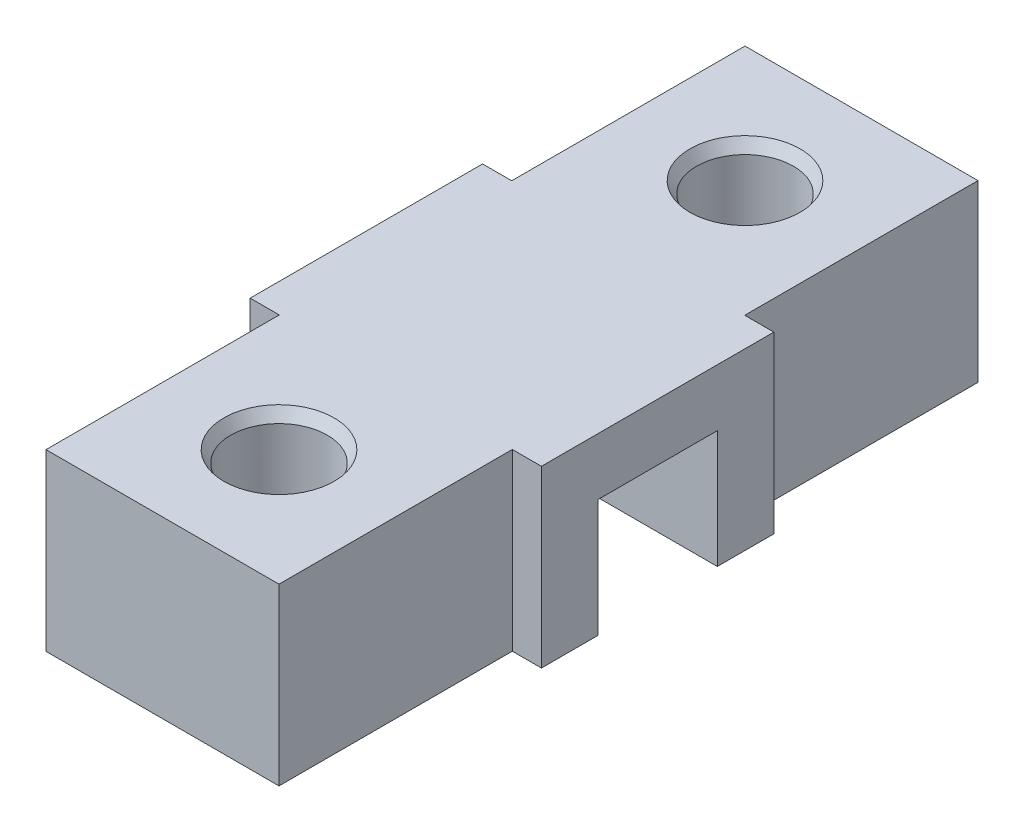
ISO-10303-21;
HEADER;
FILE_DESCRIPTION(('STEP AP214'),'2;1');
FILE_NAME('part.step','',(''),(''),'','','');
FILE_SCHEMA(('AUTOMOTIVE_DESIGN { 1 0 10303 214 1 1 1 1 }'));
ENDSEC;
DATA;
#1=APPLICATION_CONTEXT('core data for automotive mechanical design processes');
#2=APPLICATION_PROTOCOL_DEFINITION('international standard','automotive_design',2000,#1);
#3=PRODUCT_CONTEXT('',#1,'mechanical');
#4=PRODUCT('Part','Part','',(#3));
#5=PRODUCT_RELATED_PRODUCT_CATEGORY('part','',(#4));
#6=PRODUCT_DEFINITION_FORMATION('','',#4);
#7=PRODUCT_DEFINITION_CONTEXT('part definition',#1,'design');
#8=PRODUCT_DEFINITION('design','',#6,#7);
#9=PRODUCT_DEFINITION_SHAPE('','',#8);
#10=(LENGTH_UNIT() NAMED_UNIT(*) SI_UNIT(.MILLI.,.METRE.));
#11=(NAMED_UNIT(*) PLANE_ANGLE_UNIT() SI_UNIT($,.RADIAN.));
#12=(NAMED_UNIT(*) SI_UNIT($,.STERADIAN.) SOLID_ANGLE_UNIT());
#13=UNCERTAINTY_MEASURE_WITH_UNIT(LENGTH_MEASURE(1.E-05),#10,'distance_accuracy_value','');
#14=(GEOMETRIC_REPRESENTATION_CONTEXT(3) GLOBAL_UNCERTAINTY_ASSIGNED_CONTEXT((#13)) GLOBAL_UNIT_ASSIGNED_CONTEXT((#10,
#11,#12)) REPRESENTATION_CONTEXT('',''));
#15=CARTESIAN_POINT('',(0.,0.,0.));
#16=DIRECTION('',(0.,0.,1.));
#17=DIRECTION('',(1.,0.,0.));
#18=AXIS2_PLACEMENT_3D('',#15,#16,#17);
#19=CARTESIAN_POINT('',(-10.,15.,30.));
#20=DIRECTION('',(1.,0.,0.));
#21=DIRECTION('',(0.,0.,-1.));
#22=AXIS2_PLACEMENT_3D('',#19,#20,#21);
#23=PLANE('',#22);
#24=DIRECTION('',(0.,0.,1.));
#25=VECTOR('',#24,1.);
#26=CARTESIAN_POINT('',(-10.,15.,30.));
#27=LINE('',#26,#25);
#28=CARTESIAN_POINT('',(-10.,15.,9.975));
#29=VERTEX_POINT('',#28);
#30=CARTESIAN_POINT('',(-10.,15.,30.));
#31=VERTEX_POINT('',#30);
#32=EDGE_CURVE('E249',#29,#31,#27,.T.);
#33=ORIENTED_EDGE('',*,*,#32,.F.);
#34=DIRECTION('',(0.,-1.,0.));
#35=VECTOR('',#34,1.);
#36=CARTESIAN_POINT('',(-10.,15.,9.975));
#37=LINE('',#36,#35);
#38=CARTESIAN_POINT('',(-10.,0.,9.975));
#39=VERTEX_POINT('',#38);
#40=EDGE_CURVE('E50',#29,#39,#37,.T.);
#41=ORIENTED_EDGE('',*,*,#40,.T.);
#42=DIRECTION('',(0.,0.,1.));
#43=VECTOR('',#42,1.);
#44=CARTESIAN_POINT('',(-10.,0.,30.));
#45=LINE('',#44,#43);
#46=CARTESIAN_POINT('',(-10.,0.,30.));
#47=VERTEX_POINT('',#46);
#48=EDGE_CURVE('E159',#39,#47,#45,.T.);
#49=ORIENTED_EDGE('',*,*,#48,.T.);
#50=DIRECTION('',(0.,-1.,0.));
#51=VECTOR('',#50,1.);
#52=CARTESIAN_POINT('',(-10.,15.,30.));
#53=LINE('',#52,#51);
#54=EDGE_CURVE('E273',#31,#47,#53,.T.);
#55=ORIENTED_EDGE('',*,*,#54,.F.);
#56=EDGE_LOOP('',(#33,#41,#49,#55));
#57=FACE_BOUND('',#56,.T.);
#58=ADVANCED_FACE('F35',(#57),#23,.F.);
#59=CARTESIAN_POINT('',(10.,15.,30.));
#60=DIRECTION('',(-1.,0.,0.));
#61=DIRECTION('',(0.,0.,1.));
#62=AXIS2_PLACEMENT_3D('',#59,#60,#61);
#63=PLANE('',#62);
#64=DIRECTION('',(0.,0.,-1.));
#65=VECTOR('',#64,1.);
#66=CARTESIAN_POINT('',(10.,0.,30.));
#67=LINE('',#66,#65);
#68=CARTESIAN_POINT('',(10.,0.,30.));
#69=VERTEX_POINT('',#68);
#70=CARTESIAN_POINT('',(10.,0.,9.975));
#71=VERTEX_POINT('',#70);
#72=EDGE_CURVE('E58',#69,#71,#67,.T.);
#73=ORIENTED_EDGE('',*,*,#72,.T.);
#74=DIRECTION('',(0.,1.,0.));
#75=VECTOR('',#74,1.);
#76=CARTESIAN_POINT('',(10.,15.,9.975));
#77=LINE('',#76,#75);
#78=CARTESIAN_POINT('',(10.,15.,9.975));
#79=VERTEX_POINT('',#78);
#80=EDGE_CURVE('E231',#71,#79,#77,.T.);
#81=ORIENTED_EDGE('',*,*,#80,.T.);
#82=DIRECTION('',(0.,0.,-1.));
#83=VECTOR('',#82,1.);
#84=CARTESIAN_POINT('',(10.,15.,30.));
#85=LINE('',#84,#83);
#86=CARTESIAN_POINT('',(10.,15.,30.));
#87=VERTEX_POINT('',#86);
#88=EDGE_CURVE('E252',#87,#79,#85,.T.);
#89=ORIENTED_EDGE('',*,*,#88,.F.);
#90=DIRECTION('',(0.,-1.,0.));
#91=VECTOR('',#90,1.);
#92=CARTESIAN_POINT('',(10.,15.,30.));
#93=LINE('',#92,#91);
#94=EDGE_CURVE('E271',#87,#69,#93,.T.);
#95=ORIENTED_EDGE('',*,*,#94,.T.);
#96=EDGE_LOOP('',(#73,#81,#89,#95));
#97=FACE_BOUND('',#96,.T.);
#98=ADVANCED_FACE('F345',(#97),#63,.F.);
#99=CARTESIAN_POINT('',(0.,0.,0.));
#100=DIRECTION('',(0.,1.,0.));
#101=DIRECTION('',(0.,0.,1.));
#102=AXIS2_PLACEMENT_3D('',#99,#100,#101);
#103=PLANE('',#102);
#104=CARTESIAN_POINT('',(0.,0.,20.));
#105=DIRECTION('',(0.,-1.,0.));
#106=DIRECTION('',(0.,0.,-1.));
#107=AXIS2_PLACEMENT_3D('',#104,#105,#106);
#108=CIRCLE('',#107,4.15);
#109=CARTESIAN_POINT('',(0.,0.,15.85));
#110=VERTEX_POINT('',#109);
#111=EDGE_CURVE('E237',#110,#110,#108,.T.);
#112=ORIENTED_EDGE('',*,*,#111,.F.);
#113=EDGE_LOOP('',(#112));
#114=FACE_BOUND('',#113,.T.);
#115=ORIENTED_EDGE('',*,*,#48,.F.);
#116=DIRECTION('',(1.,0.,0.));
#117=VECTOR('',#116,1.);
#118=CARTESIAN_POINT('',(-12.5,0.,9.975));
#119=LINE('',#118,#117);
#120=CARTESIAN_POINT('',(-12.5,0.,9.975));
#121=VERTEX_POINT('',#120);
#122=EDGE_CURVE('E212',#121,#39,#119,.T.);
#123=ORIENTED_EDGE('',*,*,#122,.F.);
#124=DIRECTION('',(0.,0.,-1.));
#125=VECTOR('',#124,1.);
#126=CARTESIAN_POINT('',(-12.5,0.,5.125));
#127=LINE('',#126,#125);
#128=CARTESIAN_POINT('',(-12.5,0.,5.125));
#129=VERTEX_POINT('',#128);
#130=EDGE_CURVE('E208',#121,#129,#127,.T.);
#131=ORIENTED_EDGE('',*,*,#130,.T.);
#132=DIRECTION('',(1.,0.,0.));
#133=VECTOR('',#132,1.);
#134=CARTESIAN_POINT('',(-10.,0.,5.125));
#135=LINE('',#134,#133);
#136=CARTESIAN_POINT('',(12.5,0.,5.125));
#137=VERTEX_POINT('',#136);
#138=EDGE_CURVE('E239',#129,#137,#135,.T.);
#139=ORIENTED_EDGE('',*,*,#138,.T.);
#140=DIRECTION('',(0.,0.,-1.));
#141=VECTOR('',#140,1.);
#142=CARTESIAN_POINT('',(12.5,0.,5.125));
#143=LINE('',#142,#141);
#144=CARTESIAN_POINT('',(12.5,0.,9.975));
#145=VERTEX_POINT('',#144);
#146=EDGE_CURVE('E174',#145,#137,#143,.T.);
#147=ORIENTED_EDGE('',*,*,#146,.F.);
#148=EDGE_CURVE('E216',#71,#145,#119,.T.);
#149=ORIENTED_EDGE('',*,*,#148,.F.);
#150=ORIENTED_EDGE('',*,*,#72,.F.);
#151=DIRECTION('',(1.,0.,0.));
#152=VECTOR('',#151,1.);
#153=CARTESIAN_POINT('',(10.,0.,30.));
#154=LINE('',#153,#152);
#155=EDGE_CURVE('E260',#47,#69,#154,.T.);
#156=ORIENTED_EDGE('',*,*,#155,.F.);
#157=EDGE_LOOP('',(#115,#123,#131,#139,#147,#149,#150,#156));
#158=FACE_BOUND('',#157,.T.);
#159=ADVANCED_FACE('F334',(#114,#158),#103,.F.);
#160=CARTESIAN_POINT('',(-10.,0.,-30.));
#161=VERTEX_POINT('',#160);
#162=CARTESIAN_POINT('',(-10.,0.,-9.975));
#163=VERTEX_POINT('',#162);
#164=EDGE_CURVE('E258',#161,#163,#45,.T.);
#165=ORIENTED_EDGE('',*,*,#164,.T.);
#166=DIRECTION('',(0.,1.,0.));
#167=VECTOR('',#166,1.);
#168=CARTESIAN_POINT('',(-10.,15.,-9.975));
#169=LINE('',#168,#167);
#170=CARTESIAN_POINT('',(-10.,15.,-9.975));
#171=VERTEX_POINT('',#170);
#172=EDGE_CURVE('E229',#163,#171,#169,.T.);
#173=ORIENTED_EDGE('',*,*,#172,.T.);
#174=CARTESIAN_POINT('',(-10.,15.,-30.));
#175=VERTEX_POINT('',#174);
#176=EDGE_CURVE('E245',#175,#171,#27,.T.);
#177=ORIENTED_EDGE('',*,*,#176,.F.);
#178=DIRECTION('',(0.,-1.,0.));
#179=VECTOR('',#178,1.);
#180=CARTESIAN_POINT('',(-10.,15.,-30.));
#181=LINE('',#180,#179);
#182=EDGE_CURVE('E257',#175,#161,#181,.T.);
#183=ORIENTED_EDGE('',*,*,#182,.T.);
#184=EDGE_LOOP('',(#165,#173,#177,#183));
#185=FACE_BOUND('',#184,.T.);
#186=ADVANCED_FACE('F353',(#185),#23,.F.);
#187=CARTESIAN_POINT('',(10.,15.,30.));
#188=DIRECTION('',(0.,0.,-1.));
#189=DIRECTION('',(-1.,0.,0.));
#190=AXIS2_PLACEMENT_3D('',#187,#188,#189);
#191=PLANE('',#190);
#192=ORIENTED_EDGE('',*,*,#155,.T.);
#193=ORIENTED_EDGE('',*,*,#94,.F.);
#194=DIRECTION('',(1.,0.,0.));
#195=VECTOR('',#194,1.);
#196=CARTESIAN_POINT('',(10.,15.,30.));
#197=LINE('',#196,#195);
#198=EDGE_CURVE('E248',#31,#87,#197,.T.);
#199=ORIENTED_EDGE('',*,*,#198,.F.);
#200=ORIENTED_EDGE('',*,*,#54,.T.);
#201=EDGE_LOOP('',(#192,#193,#199,#200));
#202=FACE_BOUND('',#201,.T.);
#203=ADVANCED_FACE('F342',(#202),#191,.F.);
#204=CARTESIAN_POINT('',(10.,15.,-9.975));
#205=VERTEX_POINT('',#204);
#206=CARTESIAN_POINT('',(10.,15.,-30.));
#207=VERTEX_POINT('',#206);
#208=EDGE_CURVE('E251',#205,#207,#85,.T.);
#209=ORIENTED_EDGE('',*,*,#208,.F.);
#210=DIRECTION('',(0.,-1.,0.));
#211=VECTOR('',#210,1.);
#212=CARTESIAN_POINT('',(10.,15.,-9.975));
#213=LINE('',#212,#211);
#214=CARTESIAN_POINT('',(10.,0.,-9.975));
#215=VERTEX_POINT('',#214);
#216=EDGE_CURVE('E215',#205,#215,#213,.T.);
#217=ORIENTED_EDGE('',*,*,#216,.T.);
#218=CARTESIAN_POINT('',(10.,0.,-30.));
#219=VERTEX_POINT('',#218);
#220=EDGE_CURVE('E262',#215,#219,#67,.T.);
#221=ORIENTED_EDGE('',*,*,#220,.T.);
#222=DIRECTION('',(0.,-1.,0.));
#223=VECTOR('',#222,1.);
#224=CARTESIAN_POINT('',(10.,15.,-30.));
#225=LINE('',#224,#223);
#226=EDGE_CURVE('E268',#207,#219,#225,.T.);
#227=ORIENTED_EDGE('',*,*,#226,.F.);
#228=EDGE_LOOP('',(#209,#217,#221,#227));
#229=FACE_BOUND('',#228,.T.);
#230=ADVANCED_FACE('F348',(#229),#63,.F.);
#231=CARTESIAN_POINT('',(10.,15.,-30.));
#232=DIRECTION('',(0.,0.,1.));
#233=DIRECTION('',(1.,0.,0.));
#234=AXIS2_PLACEMENT_3D('',#231,#232,#233);
#235=PLANE('',#234);
#236=DIRECTION('',(-1.,0.,0.));
#237=VECTOR('',#236,1.);
#238=CARTESIAN_POINT('',(10.,0.,-30.));
#239=LINE('',#238,#237);
#240=EDGE_CURVE('E264',#219,#161,#239,.T.);
#241=ORIENTED_EDGE('',*,*,#240,.T.);
#242=ORIENTED_EDGE('',*,*,#182,.F.);
#243=DIRECTION('',(-1.,0.,0.));
#244=VECTOR('',#243,1.);
#245=CARTESIAN_POINT('',(10.,15.,-30.));
#246=LINE('',#245,#244);
#247=EDGE_CURVE('E255',#207,#175,#246,.T.);
#248=ORIENTED_EDGE('',*,*,#247,.F.);
#249=ORIENTED_EDGE('',*,*,#226,.T.);
#250=EDGE_LOOP('',(#241,#242,#248,#249));
#251=FACE_BOUND('',#250,.T.);
#252=ADVANCED_FACE('F297',(#251),#235,.F.);
#253=CARTESIAN_POINT('',(0.,15.,0.));
#254=DIRECTION('',(0.,1.,0.));
#255=DIRECTION('',(0.,0.,1.));
#256=AXIS2_PLACEMENT_3D('',#253,#254,#255);
#257=PLANE('',#256);
#258=CARTESIAN_POINT('',(0.,15.,-20.));
#259=DIRECTION('',(0.,1.,0.));
#260=DIRECTION('',(0.,0.,1.));
#261=AXIS2_PLACEMENT_3D('',#258,#259,#260);
#262=CIRCLE('',#261,4.72735026918962);
#263=CARTESIAN_POINT('',(0.,15.,-15.2726497308104));
#264=VERTEX_POINT('',#263);
#265=EDGE_CURVE('E279',#264,#264,#262,.F.);
#266=ORIENTED_EDGE('',*,*,#265,.T.);
#267=EDGE_LOOP('',(#266));
#268=FACE_BOUND('',#267,.T.);
#269=CARTESIAN_POINT('',(0.,15.,20.));
#270=DIRECTION('',(0.,1.,0.));
#271=DIRECTION('',(0.,0.,1.));
#272=AXIS2_PLACEMENT_3D('',#269,#270,#271);
#273=CIRCLE('',#272,4.72735026918962);
#274=CARTESIAN_POINT('',(0.,15.,24.7273502691896));
#275=VERTEX_POINT('',#274);
#276=EDGE_CURVE('E276',#275,#275,#273,.F.);
#277=ORIENTED_EDGE('',*,*,#276,.T.);
#278=EDGE_LOOP('',(#277));
#279=FACE_BOUND('',#278,.T.);
#280=ORIENTED_EDGE('',*,*,#176,.T.);
#281=DIRECTION('',(1.,0.,0.));
#282=VECTOR('',#281,1.);
#283=CARTESIAN_POINT('',(-12.5,15.,-9.975));
#284=LINE('',#283,#282);
#285=CARTESIAN_POINT('',(-12.5,15.,-9.975));
#286=VERTEX_POINT('',#285);
#287=EDGE_CURVE('E221',#286,#171,#284,.T.);
#288=ORIENTED_EDGE('',*,*,#287,.F.);
#289=DIRECTION('',(0.,0.,1.));
#290=VECTOR('',#289,1.);
#291=CARTESIAN_POINT('',(-12.5,15.,9.975));
#292=LINE('',#291,#290);
#293=CARTESIAN_POINT('',(-12.5,15.,9.975));
#294=VERTEX_POINT('',#293);
#295=EDGE_CURVE('E202',#286,#294,#292,.T.);
#296=ORIENTED_EDGE('',*,*,#295,.T.);
#297=DIRECTION('',(1.,0.,0.));
#298=VECTOR('',#297,1.);
#299=CARTESIAN_POINT('',(-12.5,15.,9.975));
#300=LINE('',#299,#298);
#301=EDGE_CURVE('E217',#294,#29,#300,.T.);
#302=ORIENTED_EDGE('',*,*,#301,.T.);
#303=ORIENTED_EDGE('',*,*,#32,.T.);
#304=ORIENTED_EDGE('',*,*,#198,.T.);
#305=ORIENTED_EDGE('',*,*,#88,.T.);
#306=CARTESIAN_POINT('',(12.5,15.,9.975));
#307=VERTEX_POINT('',#306);
#308=EDGE_CURVE('E220',#79,#307,#300,.T.);
#309=ORIENTED_EDGE('',*,*,#308,.T.);
#310=DIRECTION('',(0.,0.,1.));
#311=VECTOR('',#310,1.);
#312=CARTESIAN_POINT('',(12.5,15.,9.975));
#313=LINE('',#312,#311);
#314=CARTESIAN_POINT('',(12.5,15.,-9.975));
#315=VERTEX_POINT('',#314);
#316=EDGE_CURVE('E184',#315,#307,#313,.T.);
#317=ORIENTED_EDGE('',*,*,#316,.F.);
#318=EDGE_CURVE('E224',#205,#315,#284,.T.);
#319=ORIENTED_EDGE('',*,*,#318,.F.);
#320=ORIENTED_EDGE('',*,*,#208,.T.);
#321=ORIENTED_EDGE('',*,*,#247,.T.);
#322=EDGE_LOOP('',(#280,#288,#296,#302,#303,#304,#305,#309,#317,#319,#320,#321));
#323=FACE_BOUND('',#322,.T.);
#324=ADVANCED_FACE('F293',(#268,#279,#323),#257,.T.);
#325=CARTESIAN_POINT('',(0.,0.,-20.));
#326=DIRECTION('',(0.,-1.,0.));
#327=DIRECTION('',(0.,0.,-1.));
#328=AXIS2_PLACEMENT_3D('',#325,#326,#327);
#329=CIRCLE('',#328,4.15);
#330=CARTESIAN_POINT('',(0.,0.,-24.15));
#331=VERTEX_POINT('',#330);
#332=EDGE_CURVE('E234',#331,#331,#329,.T.);
#333=ORIENTED_EDGE('',*,*,#332,.F.);
#334=EDGE_LOOP('',(#333));
#335=FACE_BOUND('',#334,.T.);
#336=ORIENTED_EDGE('',*,*,#220,.F.);
#337=DIRECTION('',(1.,0.,0.));
#338=VECTOR('',#337,1.);
#339=CARTESIAN_POINT('',(-12.5,0.,-9.975));
#340=LINE('',#339,#338);
#341=CARTESIAN_POINT('',(12.5,0.,-9.975));
#342=VERTEX_POINT('',#341);
#343=EDGE_CURVE('E211',#215,#342,#340,.T.);
#344=ORIENTED_EDGE('',*,*,#343,.T.);
#345=DIRECTION('',(0.,0.,-1.));
#346=VECTOR('',#345,1.);
#347=CARTESIAN_POINT('',(12.5,0.,-9.975));
#348=LINE('',#347,#346);
#349=CARTESIAN_POINT('',(12.5,0.,-5.125));
#350=VERTEX_POINT('',#349);
#351=EDGE_CURVE('E178',#350,#342,#348,.T.);
#352=ORIENTED_EDGE('',*,*,#351,.F.);
#353=DIRECTION('',(1.,0.,0.));
#354=VECTOR('',#353,1.);
#355=CARTESIAN_POINT('',(-10.,0.,-5.125));
#356=LINE('',#355,#354);
#357=CARTESIAN_POINT('',(-12.5,0.,-5.125));
#358=VERTEX_POINT('',#357);
#359=EDGE_CURVE('E242',#358,#350,#356,.T.);
#360=ORIENTED_EDGE('',*,*,#359,.F.);
#361=DIRECTION('',(0.,0.,-1.));
#362=VECTOR('',#361,1.);
#363=CARTESIAN_POINT('',(-12.5,0.,-9.975));
#364=LINE('',#363,#362);
#365=CARTESIAN_POINT('',(-12.5,0.,-9.975));
#366=VERTEX_POINT('',#365);
#367=EDGE_CURVE('E196',#358,#366,#364,.T.);
#368=ORIENTED_EDGE('',*,*,#367,.T.);
#369=EDGE_CURVE('E225',#366,#163,#340,.T.);
#370=ORIENTED_EDGE('',*,*,#369,.T.);
#371=ORIENTED_EDGE('',*,*,#164,.F.);
#372=ORIENTED_EDGE('',*,*,#240,.F.);
#373=EDGE_LOOP('',(#336,#344,#352,#360,#368,#370,#371,#372));
#374=FACE_BOUND('',#373,.T.);
#375=ADVANCED_FACE('F296',(#335,#374),#103,.F.);
#376=CARTESIAN_POINT('',(-10.,10.1,-5.125));
#377=DIRECTION('',(0.,1.,0.));
#378=DIRECTION('',(0.,0.,1.));
#379=AXIS2_PLACEMENT_3D('',#376,#377,#378);
#380=PLANE('',#379);
#381=DIRECTION('',(1.,0.,0.));
#382=VECTOR('',#381,1.);
#383=CARTESIAN_POINT('',(-10.,10.1,5.125));
#384=LINE('',#383,#382);
#385=CARTESIAN_POINT('',(-12.5,10.1,5.125));
#386=VERTEX_POINT('',#385);
#387=CARTESIAN_POINT('',(12.5,10.1,5.125));
#388=VERTEX_POINT('',#387);
#389=EDGE_CURVE('E149',#386,#388,#384,.T.);
#390=ORIENTED_EDGE('',*,*,#389,.F.);
#391=DIRECTION('',(0.,0.,-1.));
#392=VECTOR('',#391,1.);
#393=CARTESIAN_POINT('',(-12.5,10.1,-5.125));
#394=LINE('',#393,#392);
#395=CARTESIAN_POINT('',(-12.5,10.1,-5.125));
#396=VERTEX_POINT('',#395);
#397=EDGE_CURVE('E191',#386,#396,#394,.T.);
#398=ORIENTED_EDGE('',*,*,#397,.T.);
#399=DIRECTION('',(1.,0.,0.));
#400=VECTOR('',#399,1.);
#401=CARTESIAN_POINT('',(-10.,10.1,-5.125));
#402=LINE('',#401,#400);
#403=CARTESIAN_POINT('',(12.5,10.1,-5.125));
#404=VERTEX_POINT('',#403);
#405=EDGE_CURVE('E160',#396,#404,#402,.T.);
#406=ORIENTED_EDGE('',*,*,#405,.T.);
#407=DIRECTION('',(0.,0.,-1.));
#408=VECTOR('',#407,1.);
#409=CARTESIAN_POINT('',(12.5,10.1,-5.125));
#410=LINE('',#409,#408);
#411=EDGE_CURVE('E163',#388,#404,#410,.T.);
#412=ORIENTED_EDGE('',*,*,#411,.F.);
#413=EDGE_LOOP('',(#390,#398,#406,#412));
#414=FACE_BOUND('',#413,.T.);
#415=ADVANCED_FACE('F164',(#414),#380,.F.);
#416=CARTESIAN_POINT('',(-10.,10.1,5.125));
#417=DIRECTION('',(0.,0.,1.));
#418=DIRECTION('',(0.,-1.,0.));
#419=AXIS2_PLACEMENT_3D('',#416,#417,#418);
#420=PLANE('',#419);
#421=ORIENTED_EDGE('',*,*,#138,.F.);
#422=DIRECTION('',(0.,1.,0.));
#423=VECTOR('',#422,1.);
#424=CARTESIAN_POINT('',(-12.5,10.1,5.125));
#425=LINE('',#424,#423);
#426=EDGE_CURVE('E155',#129,#386,#425,.T.);
#427=ORIENTED_EDGE('',*,*,#426,.T.);
#428=ORIENTED_EDGE('',*,*,#389,.T.);
#429=DIRECTION('',(0.,1.,0.));
#430=VECTOR('',#429,1.);
#431=CARTESIAN_POINT('',(12.5,10.1,5.125));
#432=LINE('',#431,#430);
#433=EDGE_CURVE('E153',#137,#388,#432,.T.);
#434=ORIENTED_EDGE('',*,*,#433,.F.);
#435=EDGE_LOOP('',(#421,#427,#428,#434));
#436=FACE_BOUND('',#435,.T.);
#437=ADVANCED_FACE('F151',(#436),#420,.F.);
#438=CARTESIAN_POINT('',(-10.,10.1,-5.125));
#439=DIRECTION('',(0.,0.,-1.));
#440=DIRECTION('',(0.,1.,0.));
#441=AXIS2_PLACEMENT_3D('',#438,#439,#440);
#442=PLANE('',#441);
#443=ORIENTED_EDGE('',*,*,#405,.F.);
#444=DIRECTION('',(0.,-1.,0.));
#445=VECTOR('',#444,1.);
#446=CARTESIAN_POINT('',(-12.5,0.,-5.125));
#447=LINE('',#446,#445);
#448=EDGE_CURVE('E193',#396,#358,#447,.T.);
#449=ORIENTED_EDGE('',*,*,#448,.T.);
#450=ORIENTED_EDGE('',*,*,#359,.T.);
#451=DIRECTION('',(0.,-1.,0.));
#452=VECTOR('',#451,1.);
#453=CARTESIAN_POINT('',(12.5,0.,-5.125));
#454=LINE('',#453,#452);
#455=EDGE_CURVE('E168',#404,#350,#454,.T.);
#456=ORIENTED_EDGE('',*,*,#455,.F.);
#457=EDGE_LOOP('',(#443,#449,#450,#456));
#458=FACE_BOUND('',#457,.T.);
#459=ADVANCED_FACE('F319',(#458),#442,.F.);
#460=CARTESIAN_POINT('',(0.,15.,20.));
#461=DIRECTION('',(0.,-1.,0.));
#462=DIRECTION('',(0.,0.,-1.));
#463=AXIS2_PLACEMENT_3D('',#460,#461,#462);
#464=CYLINDRICAL_SURFACE('',#463,4.15);
#465=CARTESIAN_POINT('',(0.,14.,20.));
#466=DIRECTION('',(0.,1.,0.));
#467=DIRECTION('',(0.,0.,1.));
#468=AXIS2_PLACEMENT_3D('',#465,#466,#467);
#469=CIRCLE('',#468,4.15);
#470=CARTESIAN_POINT('',(0.,14.,24.15));
#471=VERTEX_POINT('',#470);
#472=EDGE_CURVE('E11',#471,#471,#469,.T.);
#473=ORIENTED_EDGE('',*,*,#472,.T.);
#474=EDGE_LOOP('',(#473));
#475=FACE_BOUND('',#474,.T.);
#476=ORIENTED_EDGE('',*,*,#111,.T.);
#477=EDGE_LOOP('',(#476));
#478=FACE_BOUND('',#477,.T.);
#479=ADVANCED_FACE('F452',(#475,#478),#464,.F.);
#480=CARTESIAN_POINT('',(0.,15.,-20.));
#481=DIRECTION('',(0.,-1.,0.));
#482=DIRECTION('',(0.,0.,-1.));
#483=AXIS2_PLACEMENT_3D('',#480,#481,#482);
#484=CYLINDRICAL_SURFACE('',#483,4.15);
#485=CARTESIAN_POINT('',(0.,14.,-20.));
#486=DIRECTION('',(0.,1.,0.));
#487=DIRECTION('',(0.,0.,1.));
#488=AXIS2_PLACEMENT_3D('',#485,#486,#487);
#489=CIRCLE('',#488,4.15);
#490=CARTESIAN_POINT('',(0.,14.,-15.85));
#491=VERTEX_POINT('',#490);
#492=EDGE_CURVE('E43',#491,#491,#489,.T.);
#493=ORIENTED_EDGE('',*,*,#492,.T.);
#494=EDGE_LOOP('',(#493));
#495=FACE_BOUND('',#494,.T.);
#496=ORIENTED_EDGE('',*,*,#332,.T.);
#497=EDGE_LOOP('',(#496));
#498=FACE_BOUND('',#497,.T.);
#499=ADVANCED_FACE('F284',(#495,#498),#484,.F.);
#500=CARTESIAN_POINT('',(12.5,0.,0.));
#501=DIRECTION('',(-1.,0.,0.));
#502=DIRECTION('',(0.,0.,1.));
#503=AXIS2_PLACEMENT_3D('',#500,#501,#502);
#504=PLANE('',#503);
#505=ORIENTED_EDGE('',*,*,#433,.T.);
#506=ORIENTED_EDGE('',*,*,#411,.T.);
#507=ORIENTED_EDGE('',*,*,#455,.T.);
#508=ORIENTED_EDGE('',*,*,#351,.T.);
#509=DIRECTION('',(0.,1.,0.));
#510=VECTOR('',#509,1.);
#511=CARTESIAN_POINT('',(12.5,15.,-9.975));
#512=LINE('',#511,#510);
#513=EDGE_CURVE('E181',#342,#315,#512,.T.);
#514=ORIENTED_EDGE('',*,*,#513,.T.);
#515=ORIENTED_EDGE('',*,*,#316,.T.);
#516=DIRECTION('',(0.,-1.,0.));
#517=VECTOR('',#516,1.);
#518=CARTESIAN_POINT('',(12.5,0.,9.975));
#519=LINE('',#518,#517);
#520=EDGE_CURVE('E187',#307,#145,#519,.T.);
#521=ORIENTED_EDGE('',*,*,#520,.T.);
#522=ORIENTED_EDGE('',*,*,#146,.T.);
#523=EDGE_LOOP('',(#505,#506,#507,#508,#514,#515,#521,#522));
#524=FACE_BOUND('',#523,.T.);
#525=ADVANCED_FACE('F171',(#524),#504,.F.);
#526=CARTESIAN_POINT('',(-12.5,15.,-9.975));
#527=DIRECTION('',(0.,0.,-1.));
#528=DIRECTION('',(-1.,0.,0.));
#529=AXIS2_PLACEMENT_3D('',#526,#527,#528);
#530=PLANE('',#529);
#531=ORIENTED_EDGE('',*,*,#216,.F.);
#532=ORIENTED_EDGE('',*,*,#318,.T.);
#533=ORIENTED_EDGE('',*,*,#513,.F.);
#534=ORIENTED_EDGE('',*,*,#343,.F.);
#535=EDGE_LOOP('',(#531,#532,#533,#534));
#536=FACE_BOUND('',#535,.T.);
#537=ADVANCED_FACE('F325',(#536),#530,.T.);
#538=CARTESIAN_POINT('',(-12.5,0.,9.975));
#539=DIRECTION('',(0.,0.,1.));
#540=DIRECTION('',(1.,0.,0.));
#541=AXIS2_PLACEMENT_3D('',#538,#539,#540);
#542=PLANE('',#541);
#543=ORIENTED_EDGE('',*,*,#80,.F.);
#544=ORIENTED_EDGE('',*,*,#148,.T.);
#545=ORIENTED_EDGE('',*,*,#520,.F.);
#546=ORIENTED_EDGE('',*,*,#308,.F.);
#547=EDGE_LOOP('',(#543,#544,#545,#546));
#548=FACE_BOUND('',#547,.T.);
#549=ADVANCED_FACE('F331',(#548),#542,.T.);
#550=ORIENTED_EDGE('',*,*,#40,.F.);
#551=ORIENTED_EDGE('',*,*,#301,.F.);
#552=DIRECTION('',(0.,-1.,0.));
#553=VECTOR('',#552,1.);
#554=CARTESIAN_POINT('',(-12.5,0.,9.975));
#555=LINE('',#554,#553);
#556=EDGE_CURVE('E205',#294,#121,#555,.T.);
#557=ORIENTED_EDGE('',*,*,#556,.T.);
#558=ORIENTED_EDGE('',*,*,#122,.T.);
#559=EDGE_LOOP('',(#550,#551,#557,#558));
#560=FACE_BOUND('',#559,.T.);
#561=ADVANCED_FACE('F339',(#560),#542,.T.);
#562=ORIENTED_EDGE('',*,*,#172,.F.);
#563=ORIENTED_EDGE('',*,*,#369,.F.);
#564=DIRECTION('',(0.,1.,0.));
#565=VECTOR('',#564,1.);
#566=CARTESIAN_POINT('',(-12.5,15.,-9.975));
#567=LINE('',#566,#565);
#568=EDGE_CURVE('E199',#366,#286,#567,.T.);
#569=ORIENTED_EDGE('',*,*,#568,.T.);
#570=ORIENTED_EDGE('',*,*,#287,.T.);
#571=EDGE_LOOP('',(#562,#563,#569,#570));
#572=FACE_BOUND('',#571,.T.);
#573=ADVANCED_FACE('F308',(#572),#530,.T.);
#574=CARTESIAN_POINT('',(-12.5,0.,0.));
#575=DIRECTION('',(-1.,0.,0.));
#576=DIRECTION('',(0.,0.,1.));
#577=AXIS2_PLACEMENT_3D('',#574,#575,#576);
#578=PLANE('',#577);
#579=ORIENTED_EDGE('',*,*,#426,.F.);
#580=ORIENTED_EDGE('',*,*,#130,.F.);
#581=ORIENTED_EDGE('',*,*,#556,.F.);
#582=ORIENTED_EDGE('',*,*,#295,.F.);
#583=ORIENTED_EDGE('',*,*,#568,.F.);
#584=ORIENTED_EDGE('',*,*,#367,.F.);
#585=ORIENTED_EDGE('',*,*,#448,.F.);
#586=ORIENTED_EDGE('',*,*,#397,.F.);
#587=EDGE_LOOP('',(#579,#580,#581,#582,#583,#584,#585,#586));
#588=FACE_BOUND('',#587,.T.);
#589=ADVANCED_FACE('F290',(#588),#578,.T.);
#590=CARTESIAN_POINT('',(0.,15.,-20.));
#591=DIRECTION('',(0.,1.,0.));
#592=DIRECTION('',(0.,0.,1.));
#593=AXIS2_PLACEMENT_3D('',#590,#591,#592);
#594=CONICAL_SURFACE('',#593,4.72735026918962,0.523598775598295);
#595=ORIENTED_EDGE('',*,*,#492,.F.);
#596=EDGE_LOOP('',(#595));
#597=FACE_BOUND('',#596,.T.);
#598=ORIENTED_EDGE('',*,*,#265,.F.);
#599=EDGE_LOOP('',(#598));
#600=FACE_BOUND('',#599,.T.);
#601=ADVANCED_FACE('F287',(#597,#600),#594,.F.);
#602=CARTESIAN_POINT('',(0.,15.,20.));
#603=DIRECTION('',(0.,1.,0.));
#604=DIRECTION('',(0.,0.,1.));
#605=AXIS2_PLACEMENT_3D('',#602,#603,#604);
#606=CONICAL_SURFACE('',#605,4.72735026918962,0.523598775598295);
#607=ORIENTED_EDGE('',*,*,#472,.F.);
#608=EDGE_LOOP('',(#607));
#609=FACE_BOUND('',#608,.T.);
#610=ORIENTED_EDGE('',*,*,#276,.F.);
#611=EDGE_LOOP('',(#610));
#612=FACE_BOUND('',#611,.T.);
#613=ADVANCED_FACE('F37',(#609,#612),#606,.F.);
#614=CLOSED_SHELL('',(#58,#98,#159,#186,#203,#230,#252,#324,#375,#415,#437,#459,#479,#499,#525,
#537,#549,#561,#573,#589,#601,#613));
#615=MANIFOLD_SOLID_BREP('B2',#614);
#616=ADVANCED_BREP_SHAPE_REPRESENTATION('',(#18,#615),#14);
#617=SHAPE_DEFINITION_REPRESENTATION(#9,#616);
ENDSEC;
END-ISO-10303-21;
